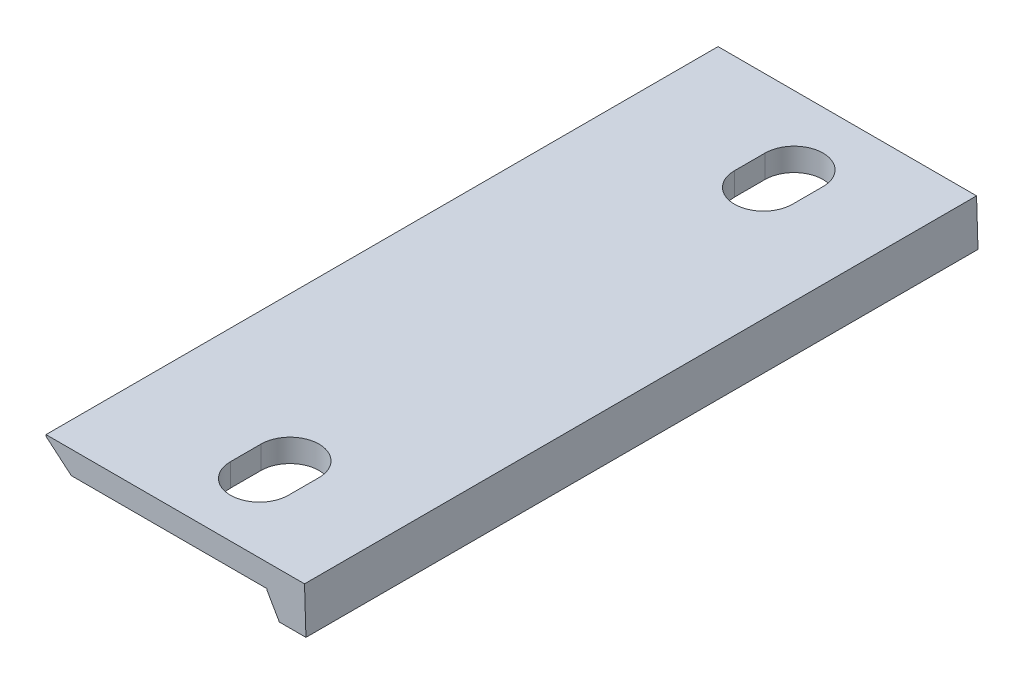
ISO-10303-21;
HEADER;
FILE_DESCRIPTION(('STEP AP214'),'2;1');
FILE_NAME('part.step','',(''),(''),'','','');
FILE_SCHEMA(('AUTOMOTIVE_DESIGN { 1 0 10303 214 1 1 1 1 }'));
ENDSEC;
DATA;
#1=APPLICATION_CONTEXT('core data for automotive mechanical design processes');
#2=APPLICATION_PROTOCOL_DEFINITION('international standard','automotive_design',2000,#1);
#3=PRODUCT_CONTEXT('',#1,'mechanical');
#4=PRODUCT('Part','Part','',(#3));
#5=PRODUCT_RELATED_PRODUCT_CATEGORY('part','',(#4));
#6=PRODUCT_DEFINITION_FORMATION('','',#4);
#7=PRODUCT_DEFINITION_CONTEXT('part definition',#1,'design');
#8=PRODUCT_DEFINITION('design','',#6,#7);
#9=PRODUCT_DEFINITION_SHAPE('','',#8);
#10=(LENGTH_UNIT() NAMED_UNIT(*) SI_UNIT(.MILLI.,.METRE.));
#11=(NAMED_UNIT(*) PLANE_ANGLE_UNIT() SI_UNIT($,.RADIAN.));
#12=(NAMED_UNIT(*) SI_UNIT($,.STERADIAN.) SOLID_ANGLE_UNIT());
#13=UNCERTAINTY_MEASURE_WITH_UNIT(LENGTH_MEASURE(1.E-05),#10,'distance_accuracy_value','');
#14=(GEOMETRIC_REPRESENTATION_CONTEXT(3) GLOBAL_UNCERTAINTY_ASSIGNED_CONTEXT((#13)) GLOBAL_UNIT_ASSIGNED_CONTEXT((#10,
#11,#12)) REPRESENTATION_CONTEXT('',''));
#15=CARTESIAN_POINT('',(0.,0.,0.));
#16=DIRECTION('',(0.,0.,1.));
#17=DIRECTION('',(1.,0.,0.));
#18=AXIS2_PLACEMENT_3D('',#15,#16,#17);
#19=CARTESIAN_POINT('',(170.193520620734,-29.9061625778583,-440.));
#20=DIRECTION('',(0.999505742252397,0.0314367810770357,0.));
#21=DIRECTION('',(-0.0314367810770357,0.999505742252397,0.));
#22=AXIS2_PLACEMENT_3D('',#19,#20,#21);
#23=PLANE('',#22);
#24=DIRECTION('',(-0.0314367810770357,0.999505742252397,0.));
#25=VECTOR('',#24,1.);
#26=CARTESIAN_POINT('',(170.193520620734,-29.9061625778583,0.));
#27=LINE('',#26,#25);
#28=CARTESIAN_POINT('',(170.193520620734,-29.9061625778583,0.));
#29=VERTEX_POINT('',#28);
#30=CARTESIAN_POINT('',(169.252902226991,0.,0.));
#31=VERTEX_POINT('',#30);
#32=EDGE_CURVE('E210',#29,#31,#27,.T.);
#33=ORIENTED_EDGE('',*,*,#32,.F.);
#34=DIRECTION('',(0.,0.,1.));
#35=VECTOR('',#34,1.);
#36=CARTESIAN_POINT('',(170.193520620734,-29.9061625778583,-440.));
#37=LINE('',#36,#35);
#38=CARTESIAN_POINT('',(170.193520620734,-29.9061625778583,-440.));
#39=VERTEX_POINT('',#38);
#40=EDGE_CURVE('E11',#39,#29,#37,.T.);
#41=ORIENTED_EDGE('',*,*,#40,.F.);
#42=DIRECTION('',(-0.0314367810770357,0.999505742252397,0.));
#43=VECTOR('',#42,1.);
#44=CARTESIAN_POINT('',(170.193520620734,-29.9061625778583,-440.));
#45=LINE('',#44,#43);
#46=CARTESIAN_POINT('',(169.252902226991,0.,-440.));
#47=VERTEX_POINT('',#46);
#48=EDGE_CURVE('E211',#39,#47,#45,.T.);
#49=ORIENTED_EDGE('',*,*,#48,.T.);
#50=DIRECTION('',(0.,0.,1.));
#51=VECTOR('',#50,1.);
#52=CARTESIAN_POINT('',(169.252902226991,0.,-440.));
#53=LINE('',#52,#51);
#54=EDGE_CURVE('E36',#47,#31,#53,.T.);
#55=ORIENTED_EDGE('',*,*,#54,.T.);
#56=EDGE_LOOP('',(#33,#41,#49,#55));
#57=FACE_BOUND('',#56,.T.);
#58=ADVANCED_FACE('F33',(#57),#23,.T.);
#59=CARTESIAN_POINT('',(170.193520620734,-29.9061625778583,-440.));
#60=DIRECTION('',(0.,-1.,0.));
#61=DIRECTION('',(1.,0.,0.));
#62=AXIS2_PLACEMENT_3D('',#59,#60,#61);
#63=PLANE('',#62);
#64=DIRECTION('',(1.,0.,0.));
#65=VECTOR('',#64,1.);
#66=CARTESIAN_POINT('',(170.193520620734,-29.9061625778583,0.));
#67=LINE('',#66,#65);
#68=CARTESIAN_POINT('',(152.77696605702,-29.9061625778583,0.));
#69=VERTEX_POINT('',#68);
#70=EDGE_CURVE('E215',#69,#29,#67,.T.);
#71=ORIENTED_EDGE('',*,*,#70,.F.);
#72=DIRECTION('',(0.,0.,1.));
#73=VECTOR('',#72,1.);
#74=CARTESIAN_POINT('',(152.77696605702,-29.9061625778583,-440.));
#75=LINE('',#74,#73);
#76=CARTESIAN_POINT('',(152.77696605702,-29.9061625778583,-440.));
#77=VERTEX_POINT('',#76);
#78=EDGE_CURVE('E41',#77,#69,#75,.T.);
#79=ORIENTED_EDGE('',*,*,#78,.F.);
#80=DIRECTION('',(1.,0.,0.));
#81=VECTOR('',#80,1.);
#82=CARTESIAN_POINT('',(170.193520620734,-29.9061625778583,-440.));
#83=LINE('',#82,#81);
#84=EDGE_CURVE('E233',#77,#39,#83,.T.);
#85=ORIENTED_EDGE('',*,*,#84,.T.);
#86=ORIENTED_EDGE('',*,*,#40,.T.);
#87=EDGE_LOOP('',(#71,#79,#85,#86));
#88=FACE_BOUND('',#87,.T.);
#89=ADVANCED_FACE('F279',(#88),#63,.T.);
#90=CARTESIAN_POINT('',(144.748239349299,-16.,-440.));
#91=DIRECTION('',(-0.866025403784439,-0.5,0.));
#92=DIRECTION('',(0.5,-0.866025403784439,0.));
#93=AXIS2_PLACEMENT_3D('',#90,#91,#92);
#94=PLANE('',#93);
#95=DIRECTION('',(0.5,-0.866025403784439,0.));
#96=VECTOR('',#95,1.);
#97=CARTESIAN_POINT('',(144.748239349299,-16.,0.));
#98=LINE('',#97,#96);
#99=CARTESIAN_POINT('',(144.748239349299,-16.,0.));
#100=VERTEX_POINT('',#99);
#101=EDGE_CURVE('E253',#100,#69,#98,.T.);
#102=ORIENTED_EDGE('',*,*,#101,.F.);
#103=DIRECTION('',(0.,0.,1.));
#104=VECTOR('',#103,1.);
#105=CARTESIAN_POINT('',(144.748239349299,-16.,-440.));
#106=LINE('',#105,#104);
#107=CARTESIAN_POINT('',(144.748239349299,-16.,-440.));
#108=VERTEX_POINT('',#107);
#109=EDGE_CURVE('E259',#108,#100,#106,.T.);
#110=ORIENTED_EDGE('',*,*,#109,.F.);
#111=DIRECTION('',(0.5,-0.866025403784439,0.));
#112=VECTOR('',#111,1.);
#113=CARTESIAN_POINT('',(144.748239349299,-16.,-440.));
#114=LINE('',#113,#112);
#115=EDGE_CURVE('E230',#108,#77,#114,.T.);
#116=ORIENTED_EDGE('',*,*,#115,.T.);
#117=ORIENTED_EDGE('',*,*,#78,.T.);
#118=EDGE_LOOP('',(#102,#110,#116,#117));
#119=FACE_BOUND('',#118,.T.);
#120=ADVANCED_FACE('F300',(#119),#94,.T.);
#121=CARTESIAN_POINT('',(144.748239349299,-15.,-440.));
#122=DIRECTION('',(-1.,0.,0.));
#123=DIRECTION('',(0.,0.,1.));
#124=AXIS2_PLACEMENT_3D('',#121,#122,#123);
#125=PLANE('',#124);
#126=DIRECTION('',(0.,-1.,0.));
#127=VECTOR('',#126,1.);
#128=CARTESIAN_POINT('',(144.748239349299,-15.,0.));
#129=LINE('',#128,#127);
#130=CARTESIAN_POINT('',(144.748239349299,-15.,0.));
#131=VERTEX_POINT('',#130);
#132=EDGE_CURVE('E250',#131,#100,#129,.T.);
#133=ORIENTED_EDGE('',*,*,#132,.F.);
#134=DIRECTION('',(0.,0.,1.));
#135=VECTOR('',#134,1.);
#136=CARTESIAN_POINT('',(144.748239349299,-15.,-440.));
#137=LINE('',#136,#135);
#138=CARTESIAN_POINT('',(144.748239349299,-15.,-440.));
#139=VERTEX_POINT('',#138);
#140=EDGE_CURVE('E261',#139,#131,#137,.T.);
#141=ORIENTED_EDGE('',*,*,#140,.F.);
#142=DIRECTION('',(0.,-1.,0.));
#143=VECTOR('',#142,1.);
#144=CARTESIAN_POINT('',(144.748239349299,-15.,-440.));
#145=LINE('',#144,#143);
#146=EDGE_CURVE('E227',#139,#108,#145,.T.);
#147=ORIENTED_EDGE('',*,*,#146,.T.);
#148=ORIENTED_EDGE('',*,*,#109,.T.);
#149=EDGE_LOOP('',(#133,#141,#147,#148));
#150=FACE_BOUND('',#149,.T.);
#151=ADVANCED_FACE('F298',(#150),#125,.T.);
#152=CARTESIAN_POINT('',(16.5650233926789,-15.,-440.));
#153=DIRECTION('',(0.,-1.,0.));
#154=DIRECTION('',(0.,0.,-1.));
#155=AXIS2_PLACEMENT_3D('',#152,#153,#154);
#156=PLANE('',#155);
#157=CARTESIAN_POINT('',(94.7482393492971,-15.,-44.9999999999999));
#158=DIRECTION('',(0.,-1.,0.));
#159=DIRECTION('',(0.,0.,-1.));
#160=AXIS2_PLACEMENT_3D('',#157,#158,#159);
#161=CIRCLE('',#160,18.9999999999948);
#162=CARTESIAN_POINT('',(113.748239349292,-15.,-44.9999999999999));
#163=VERTEX_POINT('',#162);
#164=CARTESIAN_POINT('',(75.7482393493023,-15.,-44.9999999999999));
#165=VERTEX_POINT('',#164);
#166=EDGE_CURVE('E208',#163,#165,#161,.T.);
#167=ORIENTED_EDGE('',*,*,#166,.F.);
#168=DIRECTION('',(0.,0.,1.));
#169=VECTOR('',#168,1.);
#170=CARTESIAN_POINT('',(113.748239349292,-15.,-440.));
#171=LINE('',#170,#169);
#172=CARTESIAN_POINT('',(113.748239349292,-15.,-64.9999999999999));
#173=VERTEX_POINT('',#172);
#174=EDGE_CURVE('E203',#173,#163,#171,.T.);
#175=ORIENTED_EDGE('',*,*,#174,.F.);
#176=CARTESIAN_POINT('',(94.7482393492971,-15.,-64.9999999999999));
#177=DIRECTION('',(0.,-1.,0.));
#178=DIRECTION('',(0.,0.,-1.));
#179=AXIS2_PLACEMENT_3D('',#176,#177,#178);
#180=CIRCLE('',#179,18.9999999999948);
#181=CARTESIAN_POINT('',(75.7482393493023,-15.,-64.9999999999999));
#182=VERTEX_POINT('',#181);
#183=EDGE_CURVE('E151',#182,#173,#180,.T.);
#184=ORIENTED_EDGE('',*,*,#183,.F.);
#185=DIRECTION('',(0.,0.,-1.));
#186=VECTOR('',#185,1.);
#187=CARTESIAN_POINT('',(75.7482393493023,-15.,-440.));
#188=LINE('',#187,#186);
#189=EDGE_CURVE('E206',#165,#182,#188,.T.);
#190=ORIENTED_EDGE('',*,*,#189,.F.);
#191=EDGE_LOOP('',(#167,#175,#184,#190));
#192=FACE_BOUND('',#191,.T.);
#193=CARTESIAN_POINT('',(94.7482393492989,-15.,-375.));
#194=DIRECTION('',(0.,-1.,0.));
#195=DIRECTION('',(0.,0.,-1.));
#196=AXIS2_PLACEMENT_3D('',#193,#194,#195);
#197=CIRCLE('',#196,19.);
#198=CARTESIAN_POINT('',(113.748239349299,-15.,-375.));
#199=VERTEX_POINT('',#198);
#200=CARTESIAN_POINT('',(75.7482393492988,-15.,-375.));
#201=VERTEX_POINT('',#200);
#202=EDGE_CURVE('E201',#199,#201,#197,.T.);
#203=ORIENTED_EDGE('',*,*,#202,.F.);
#204=DIRECTION('',(0.,0.,1.));
#205=VECTOR('',#204,1.);
#206=CARTESIAN_POINT('',(113.748239349299,-15.,-440.));
#207=LINE('',#206,#205);
#208=CARTESIAN_POINT('',(113.748239349299,-15.,-395.));
#209=VERTEX_POINT('',#208);
#210=EDGE_CURVE('E175',#209,#199,#207,.T.);
#211=ORIENTED_EDGE('',*,*,#210,.F.);
#212=CARTESIAN_POINT('',(94.7482393492989,-15.,-395.));
#213=DIRECTION('',(0.,-1.,0.));
#214=DIRECTION('',(0.,0.,-1.));
#215=AXIS2_PLACEMENT_3D('',#212,#213,#214);
#216=CIRCLE('',#215,19.);
#217=CARTESIAN_POINT('',(75.7482393492988,-15.,-395.));
#218=VERTEX_POINT('',#217);
#219=EDGE_CURVE('E197',#218,#209,#216,.T.);
#220=ORIENTED_EDGE('',*,*,#219,.F.);
#221=DIRECTION('',(0.,0.,-1.));
#222=VECTOR('',#221,1.);
#223=CARTESIAN_POINT('',(75.7482393492988,-15.,-440.));
#224=LINE('',#223,#222);
#225=EDGE_CURVE('E199',#201,#218,#224,.T.);
#226=ORIENTED_EDGE('',*,*,#225,.F.);
#227=EDGE_LOOP('',(#203,#211,#220,#226));
#228=FACE_BOUND('',#227,.T.);
#229=DIRECTION('',(1.,0.,0.));
#230=VECTOR('',#229,1.);
#231=CARTESIAN_POINT('',(16.5650233926789,-15.,0.));
#232=LINE('',#231,#230);
#233=CARTESIAN_POINT('',(16.5650233926789,-15.,0.));
#234=VERTEX_POINT('',#233);
#235=EDGE_CURVE('E247',#234,#131,#232,.T.);
#236=ORIENTED_EDGE('',*,*,#235,.F.);
#237=DIRECTION('',(0.,0.,1.));
#238=VECTOR('',#237,1.);
#239=CARTESIAN_POINT('',(16.5650233926789,-15.,-440.));
#240=LINE('',#239,#238);
#241=CARTESIAN_POINT('',(16.5650233926789,-15.,-440.));
#242=VERTEX_POINT('',#241);
#243=EDGE_CURVE('E263',#242,#234,#240,.T.);
#244=ORIENTED_EDGE('',*,*,#243,.F.);
#245=DIRECTION('',(1.,0.,0.));
#246=VECTOR('',#245,1.);
#247=CARTESIAN_POINT('',(16.5650233926789,-15.,-440.));
#248=LINE('',#247,#246);
#249=EDGE_CURVE('E224',#242,#139,#248,.T.);
#250=ORIENTED_EDGE('',*,*,#249,.T.);
#251=ORIENTED_EDGE('',*,*,#140,.T.);
#252=EDGE_LOOP('',(#236,#244,#250,#251));
#253=FACE_BOUND('',#252,.T.);
#254=ADVANCED_FACE('F294',(#192,#228,#253),#156,.T.);
#255=CARTESIAN_POINT('',(0.,-1.,-440.));
#256=DIRECTION('',(-0.645497224367903,-0.763762615825973,0.));
#257=DIRECTION('',(0.763762615825973,-0.645497224367903,0.));
#258=AXIS2_PLACEMENT_3D('',#255,#256,#257);
#259=PLANE('',#258);
#260=DIRECTION('',(0.763762615825973,-0.645497224367903,0.));
#261=VECTOR('',#260,1.);
#262=CARTESIAN_POINT('',(0.,-1.,0.));
#263=LINE('',#262,#261);
#264=CARTESIAN_POINT('',(0.,-1.,0.));
#265=VERTEX_POINT('',#264);
#266=EDGE_CURVE('E244',#265,#234,#263,.T.);
#267=ORIENTED_EDGE('',*,*,#266,.F.);
#268=DIRECTION('',(0.,0.,1.));
#269=VECTOR('',#268,1.);
#270=CARTESIAN_POINT('',(0.,-1.,-440.));
#271=LINE('',#270,#269);
#272=CARTESIAN_POINT('',(0.,-1.,-440.));
#273=VERTEX_POINT('',#272);
#274=EDGE_CURVE('E265',#273,#265,#271,.T.);
#275=ORIENTED_EDGE('',*,*,#274,.F.);
#276=DIRECTION('',(0.763762615825973,-0.645497224367903,0.));
#277=VECTOR('',#276,1.);
#278=CARTESIAN_POINT('',(0.,-1.,-440.));
#279=LINE('',#278,#277);
#280=EDGE_CURVE('E221',#273,#242,#279,.T.);
#281=ORIENTED_EDGE('',*,*,#280,.T.);
#282=ORIENTED_EDGE('',*,*,#243,.T.);
#283=EDGE_LOOP('',(#267,#275,#281,#282));
#284=FACE_BOUND('',#283,.T.);
#285=ADVANCED_FACE('F292',(#284),#259,.T.);
#286=CARTESIAN_POINT('',(0.,0.,-440.));
#287=DIRECTION('',(-1.,0.,0.));
#288=DIRECTION('',(0.,-1.,0.));
#289=AXIS2_PLACEMENT_3D('',#286,#287,#288);
#290=PLANE('',#289);
#291=DIRECTION('',(0.,-1.,0.));
#292=VECTOR('',#291,1.);
#293=CARTESIAN_POINT('',(0.,0.,0.));
#294=LINE('',#293,#292);
#295=CARTESIAN_POINT('',(0.,0.,0.));
#296=VERTEX_POINT('',#295);
#297=EDGE_CURVE('E241',#296,#265,#294,.T.);
#298=ORIENTED_EDGE('',*,*,#297,.F.);
#299=DIRECTION('',(0.,0.,1.));
#300=VECTOR('',#299,1.);
#301=CARTESIAN_POINT('',(0.,0.,-440.));
#302=LINE('',#301,#300);
#303=CARTESIAN_POINT('',(0.,0.,-440.));
#304=VERTEX_POINT('',#303);
#305=EDGE_CURVE('E266',#304,#296,#302,.T.);
#306=ORIENTED_EDGE('',*,*,#305,.F.);
#307=DIRECTION('',(0.,-1.,0.));
#308=VECTOR('',#307,1.);
#309=CARTESIAN_POINT('',(0.,0.,-440.));
#310=LINE('',#309,#308);
#311=EDGE_CURVE('E218',#304,#273,#310,.T.);
#312=ORIENTED_EDGE('',*,*,#311,.T.);
#313=ORIENTED_EDGE('',*,*,#274,.T.);
#314=EDGE_LOOP('',(#298,#306,#312,#313));
#315=FACE_BOUND('',#314,.T.);
#316=ADVANCED_FACE('F288',(#315),#290,.T.);
#317=CARTESIAN_POINT('',(169.252902226991,0.,-440.));
#318=DIRECTION('',(0.,1.,0.));
#319=DIRECTION('',(0.,0.,1.));
#320=AXIS2_PLACEMENT_3D('',#317,#318,#319);
#321=PLANE('',#320);
#322=CARTESIAN_POINT('',(94.7482393492971,0.,-44.9999999999999));
#323=DIRECTION('',(0.,1.,0.));
#324=DIRECTION('',(0.,0.,1.));
#325=AXIS2_PLACEMENT_3D('',#322,#323,#324);
#326=CIRCLE('',#325,18.9999999999948);
#327=CARTESIAN_POINT('',(75.7482393493023,0.,-44.9999999999999));
#328=VERTEX_POINT('',#327);
#329=CARTESIAN_POINT('',(113.748239349292,0.,-44.9999999999999));
#330=VERTEX_POINT('',#329);
#331=EDGE_CURVE('E163',#328,#330,#326,.T.);
#332=ORIENTED_EDGE('',*,*,#331,.F.);
#333=DIRECTION('',(0.,0.,1.));
#334=VECTOR('',#333,1.);
#335=CARTESIAN_POINT('',(75.7482393493023,0.,-64.9999999999999));
#336=LINE('',#335,#334);
#337=CARTESIAN_POINT('',(75.7482393493023,0.,-64.9999999999999));
#338=VERTEX_POINT('',#337);
#339=EDGE_CURVE('E168',#338,#328,#336,.T.);
#340=ORIENTED_EDGE('',*,*,#339,.F.);
#341=CARTESIAN_POINT('',(94.7482393492971,0.,-64.9999999999999));
#342=DIRECTION('',(0.,1.,0.));
#343=DIRECTION('',(0.,0.,1.));
#344=AXIS2_PLACEMENT_3D('',#341,#342,#343);
#345=CIRCLE('',#344,18.9999999999948);
#346=CARTESIAN_POINT('',(113.748239349292,0.,-64.9999999999999));
#347=VERTEX_POINT('',#346);
#348=EDGE_CURVE('E148',#347,#338,#345,.T.);
#349=ORIENTED_EDGE('',*,*,#348,.F.);
#350=DIRECTION('',(0.,0.,-1.));
#351=VECTOR('',#350,1.);
#352=CARTESIAN_POINT('',(113.748239349292,0.,-44.9999999999999));
#353=LINE('',#352,#351);
#354=EDGE_CURVE('E158',#330,#347,#353,.T.);
#355=ORIENTED_EDGE('',*,*,#354,.F.);
#356=EDGE_LOOP('',(#332,#340,#349,#355));
#357=FACE_BOUND('',#356,.T.);
#358=CARTESIAN_POINT('',(94.7482393492989,0.,-375.));
#359=DIRECTION('',(0.,1.,0.));
#360=DIRECTION('',(0.,0.,1.));
#361=AXIS2_PLACEMENT_3D('',#358,#359,#360);
#362=CIRCLE('',#361,19.);
#363=CARTESIAN_POINT('',(75.7482393492988,0.,-375.));
#364=VERTEX_POINT('',#363);
#365=CARTESIAN_POINT('',(113.748239349299,0.,-375.));
#366=VERTEX_POINT('',#365);
#367=EDGE_CURVE('E178',#364,#366,#362,.T.);
#368=ORIENTED_EDGE('',*,*,#367,.F.);
#369=DIRECTION('',(0.,0.,1.));
#370=VECTOR('',#369,1.);
#371=CARTESIAN_POINT('',(75.7482393492988,0.,-395.));
#372=LINE('',#371,#370);
#373=CARTESIAN_POINT('',(75.7482393492988,0.,-395.));
#374=VERTEX_POINT('',#373);
#375=EDGE_CURVE('E185',#374,#364,#372,.T.);
#376=ORIENTED_EDGE('',*,*,#375,.F.);
#377=CARTESIAN_POINT('',(94.7482393492989,0.,-395.));
#378=DIRECTION('',(0.,1.,0.));
#379=DIRECTION('',(0.,0.,1.));
#380=AXIS2_PLACEMENT_3D('',#377,#378,#379);
#381=CIRCLE('',#380,19.);
#382=CARTESIAN_POINT('',(113.748239349299,0.,-395.));
#383=VERTEX_POINT('',#382);
#384=EDGE_CURVE('E182',#383,#374,#381,.T.);
#385=ORIENTED_EDGE('',*,*,#384,.F.);
#386=DIRECTION('',(0.,0.,-1.));
#387=VECTOR('',#386,1.);
#388=CARTESIAN_POINT('',(113.748239349299,0.,-375.));
#389=LINE('',#388,#387);
#390=EDGE_CURVE('E180',#366,#383,#389,.T.);
#391=ORIENTED_EDGE('',*,*,#390,.F.);
#392=EDGE_LOOP('',(#368,#376,#385,#391));
#393=FACE_BOUND('',#392,.T.);
#394=DIRECTION('',(-1.,0.,0.));
#395=VECTOR('',#394,1.);
#396=CARTESIAN_POINT('',(169.252902226991,0.,0.));
#397=LINE('',#396,#395);
#398=EDGE_CURVE('E238',#31,#296,#397,.T.);
#399=ORIENTED_EDGE('',*,*,#398,.F.);
#400=ORIENTED_EDGE('',*,*,#54,.F.);
#401=DIRECTION('',(-1.,0.,0.));
#402=VECTOR('',#401,1.);
#403=CARTESIAN_POINT('',(169.252902226991,0.,-440.));
#404=LINE('',#403,#402);
#405=EDGE_CURVE('E214',#47,#304,#404,.T.);
#406=ORIENTED_EDGE('',*,*,#405,.T.);
#407=ORIENTED_EDGE('',*,*,#305,.T.);
#408=EDGE_LOOP('',(#399,#400,#406,#407));
#409=FACE_BOUND('',#408,.T.);
#410=ADVANCED_FACE('F165',(#357,#393,#409),#321,.T.);
#411=CARTESIAN_POINT('',(0.,0.,-440.));
#412=DIRECTION('',(0.,0.,1.));
#413=DIRECTION('',(1.,0.,0.));
#414=AXIS2_PLACEMENT_3D('',#411,#412,#413);
#415=PLANE('',#414);
#416=ORIENTED_EDGE('',*,*,#48,.F.);
#417=ORIENTED_EDGE('',*,*,#84,.F.);
#418=ORIENTED_EDGE('',*,*,#115,.F.);
#419=ORIENTED_EDGE('',*,*,#146,.F.);
#420=ORIENTED_EDGE('',*,*,#249,.F.);
#421=ORIENTED_EDGE('',*,*,#280,.F.);
#422=ORIENTED_EDGE('',*,*,#311,.F.);
#423=ORIENTED_EDGE('',*,*,#405,.F.);
#424=EDGE_LOOP('',(#416,#417,#418,#419,#420,#421,#422,#423));
#425=FACE_BOUND('',#424,.T.);
#426=ADVANCED_FACE('F282',(#425),#415,.F.);
#427=CARTESIAN_POINT('',(0.,0.,0.));
#428=DIRECTION('',(0.,0.,1.));
#429=DIRECTION('',(1.,0.,0.));
#430=AXIS2_PLACEMENT_3D('',#427,#428,#429);
#431=PLANE('',#430);
#432=ORIENTED_EDGE('',*,*,#32,.T.);
#433=ORIENTED_EDGE('',*,*,#398,.T.);
#434=ORIENTED_EDGE('',*,*,#297,.T.);
#435=ORIENTED_EDGE('',*,*,#266,.T.);
#436=ORIENTED_EDGE('',*,*,#235,.T.);
#437=ORIENTED_EDGE('',*,*,#132,.T.);
#438=ORIENTED_EDGE('',*,*,#101,.T.);
#439=ORIENTED_EDGE('',*,*,#70,.T.);
#440=EDGE_LOOP('',(#432,#433,#434,#435,#436,#437,#438,#439));
#441=FACE_BOUND('',#440,.T.);
#442=ADVANCED_FACE('F275',(#441),#431,.T.);
#443=CARTESIAN_POINT('',(94.7482393492989,-29.9061625778583,-375.));
#444=DIRECTION('',(0.,1.,0.));
#445=DIRECTION('',(0.,0.,1.));
#446=AXIS2_PLACEMENT_3D('',#443,#444,#445);
#447=CYLINDRICAL_SURFACE('',#446,19.);
#448=ORIENTED_EDGE('',*,*,#202,.T.);
#449=DIRECTION('',(0.,1.,0.));
#450=VECTOR('',#449,1.);
#451=CARTESIAN_POINT('',(75.7482393492988,-29.9061625778583,-375.));
#452=LINE('',#451,#450);
#453=EDGE_CURVE('E189',#201,#364,#452,.T.);
#454=ORIENTED_EDGE('',*,*,#453,.T.);
#455=ORIENTED_EDGE('',*,*,#367,.T.);
#456=DIRECTION('',(0.,1.,0.));
#457=VECTOR('',#456,1.);
#458=CARTESIAN_POINT('',(113.748239349299,-29.9061625778583,-375.));
#459=LINE('',#458,#457);
#460=EDGE_CURVE('E188',#199,#366,#459,.T.);
#461=ORIENTED_EDGE('',*,*,#460,.F.);
#462=EDGE_LOOP('',(#448,#454,#455,#461));
#463=FACE_BOUND('',#462,.T.);
#464=ADVANCED_FACE('F363',(#463),#447,.F.);
#465=CARTESIAN_POINT('',(75.7482393492988,-29.9061625778583,-395.));
#466=DIRECTION('',(-1.,0.,0.));
#467=DIRECTION('',(0.,0.,1.));
#468=AXIS2_PLACEMENT_3D('',#465,#466,#467);
#469=PLANE('',#468);
#470=ORIENTED_EDGE('',*,*,#225,.T.);
#471=DIRECTION('',(0.,1.,0.));
#472=VECTOR('',#471,1.);
#473=CARTESIAN_POINT('',(75.7482393492988,-29.9061625778583,-395.));
#474=LINE('',#473,#472);
#475=EDGE_CURVE('E191',#218,#374,#474,.T.);
#476=ORIENTED_EDGE('',*,*,#475,.T.);
#477=ORIENTED_EDGE('',*,*,#375,.T.);
#478=ORIENTED_EDGE('',*,*,#453,.F.);
#479=EDGE_LOOP('',(#470,#476,#477,#478));
#480=FACE_BOUND('',#479,.T.);
#481=ADVANCED_FACE('F384',(#480),#469,.F.);
#482=CARTESIAN_POINT('',(94.7482393492989,-29.9061625778583,-395.));
#483=DIRECTION('',(0.,1.,0.));
#484=DIRECTION('',(0.,0.,1.));
#485=AXIS2_PLACEMENT_3D('',#482,#483,#484);
#486=CYLINDRICAL_SURFACE('',#485,19.);
#487=ORIENTED_EDGE('',*,*,#219,.T.);
#488=DIRECTION('',(0.,1.,0.));
#489=VECTOR('',#488,1.);
#490=CARTESIAN_POINT('',(113.748239349299,-29.9061625778583,-395.));
#491=LINE('',#490,#489);
#492=EDGE_CURVE('E57',#209,#383,#491,.T.);
#493=ORIENTED_EDGE('',*,*,#492,.T.);
#494=ORIENTED_EDGE('',*,*,#384,.T.);
#495=ORIENTED_EDGE('',*,*,#475,.F.);
#496=EDGE_LOOP('',(#487,#493,#494,#495));
#497=FACE_BOUND('',#496,.T.);
#498=ADVANCED_FACE('F394',(#497),#486,.F.);
#499=CARTESIAN_POINT('',(113.748239349299,-29.9061625778583,-375.));
#500=DIRECTION('',(1.,0.,0.));
#501=DIRECTION('',(0.,0.,-1.));
#502=AXIS2_PLACEMENT_3D('',#499,#500,#501);
#503=PLANE('',#502);
#504=ORIENTED_EDGE('',*,*,#210,.T.);
#505=ORIENTED_EDGE('',*,*,#460,.T.);
#506=ORIENTED_EDGE('',*,*,#390,.T.);
#507=ORIENTED_EDGE('',*,*,#492,.F.);
#508=EDGE_LOOP('',(#504,#505,#506,#507));
#509=FACE_BOUND('',#508,.T.);
#510=ADVANCED_FACE('F404',(#509),#503,.F.);
#511=CARTESIAN_POINT('',(94.7482393492971,-29.9061625778583,-44.9999999999999));
#512=DIRECTION('',(0.,1.,0.));
#513=DIRECTION('',(0.,0.,1.));
#514=AXIS2_PLACEMENT_3D('',#511,#512,#513);
#515=CYLINDRICAL_SURFACE('',#514,18.9999999999948);
#516=ORIENTED_EDGE('',*,*,#166,.T.);
#517=DIRECTION('',(0.,1.,0.));
#518=VECTOR('',#517,1.);
#519=CARTESIAN_POINT('',(75.7482393493023,-29.9061625778583,-44.9999999999999));
#520=LINE('',#519,#518);
#521=EDGE_CURVE('E173',#165,#328,#520,.T.);
#522=ORIENTED_EDGE('',*,*,#521,.T.);
#523=ORIENTED_EDGE('',*,*,#331,.T.);
#524=DIRECTION('',(0.,1.,0.));
#525=VECTOR('',#524,1.);
#526=CARTESIAN_POINT('',(113.748239349292,-29.9061625778583,-44.9999999999999));
#527=LINE('',#526,#525);
#528=EDGE_CURVE('E154',#163,#330,#527,.T.);
#529=ORIENTED_EDGE('',*,*,#528,.F.);
#530=EDGE_LOOP('',(#516,#522,#523,#529));
#531=FACE_BOUND('',#530,.T.);
#532=ADVANCED_FACE('F414',(#531),#515,.F.);
#533=CARTESIAN_POINT('',(75.7482393493023,-29.9061625778583,-64.9999999999999));
#534=DIRECTION('',(-1.,0.,0.));
#535=DIRECTION('',(0.,0.,1.));
#536=AXIS2_PLACEMENT_3D('',#533,#534,#535);
#537=PLANE('',#536);
#538=ORIENTED_EDGE('',*,*,#189,.T.);
#539=DIRECTION('',(0.,1.,0.));
#540=VECTOR('',#539,1.);
#541=CARTESIAN_POINT('',(75.7482393493023,-29.9061625778583,-64.9999999999999));
#542=LINE('',#541,#540);
#543=EDGE_CURVE('E153',#182,#338,#542,.T.);
#544=ORIENTED_EDGE('',*,*,#543,.T.);
#545=ORIENTED_EDGE('',*,*,#339,.T.);
#546=ORIENTED_EDGE('',*,*,#521,.F.);
#547=EDGE_LOOP('',(#538,#544,#545,#546));
#548=FACE_BOUND('',#547,.T.);
#549=ADVANCED_FACE('F423',(#548),#537,.F.);
#550=CARTESIAN_POINT('',(94.7482393492971,-29.9061625778583,-64.9999999999999));
#551=DIRECTION('',(0.,1.,0.));
#552=DIRECTION('',(0.,0.,1.));
#553=AXIS2_PLACEMENT_3D('',#550,#551,#552);
#554=CYLINDRICAL_SURFACE('',#553,18.9999999999948);
#555=ORIENTED_EDGE('',*,*,#183,.T.);
#556=DIRECTION('',(0.,1.,0.));
#557=VECTOR('',#556,1.);
#558=CARTESIAN_POINT('',(113.748239349292,-29.9061625778583,-64.9999999999999));
#559=LINE('',#558,#557);
#560=EDGE_CURVE('E49',#173,#347,#559,.T.);
#561=ORIENTED_EDGE('',*,*,#560,.T.);
#562=ORIENTED_EDGE('',*,*,#348,.T.);
#563=ORIENTED_EDGE('',*,*,#543,.F.);
#564=EDGE_LOOP('',(#555,#561,#562,#563));
#565=FACE_BOUND('',#564,.T.);
#566=ADVANCED_FACE('F145',(#565),#554,.F.);
#567=CARTESIAN_POINT('',(113.748239349292,-29.9061625778583,-44.9999999999999));
#568=DIRECTION('',(1.,0.,0.));
#569=DIRECTION('',(0.,0.,-1.));
#570=AXIS2_PLACEMENT_3D('',#567,#568,#569);
#571=PLANE('',#570);
#572=ORIENTED_EDGE('',*,*,#174,.T.);
#573=ORIENTED_EDGE('',*,*,#528,.T.);
#574=ORIENTED_EDGE('',*,*,#354,.T.);
#575=ORIENTED_EDGE('',*,*,#560,.F.);
#576=EDGE_LOOP('',(#572,#573,#574,#575));
#577=FACE_BOUND('',#576,.T.);
#578=ADVANCED_FACE('F159',(#577),#571,.F.);
#579=CLOSED_SHELL('',(#58,#89,#120,#151,#254,#285,#316,#410,#426,#442,#464,#481,#498,#510,#532,
#549,#566,#578));
#580=MANIFOLD_SOLID_BREP('B2',#579);
#581=ADVANCED_BREP_SHAPE_REPRESENTATION('',(#18,#580),#14);
#582=SHAPE_DEFINITION_REPRESENTATION(#9,#581);
ENDSEC;
END-ISO-10303-21;
